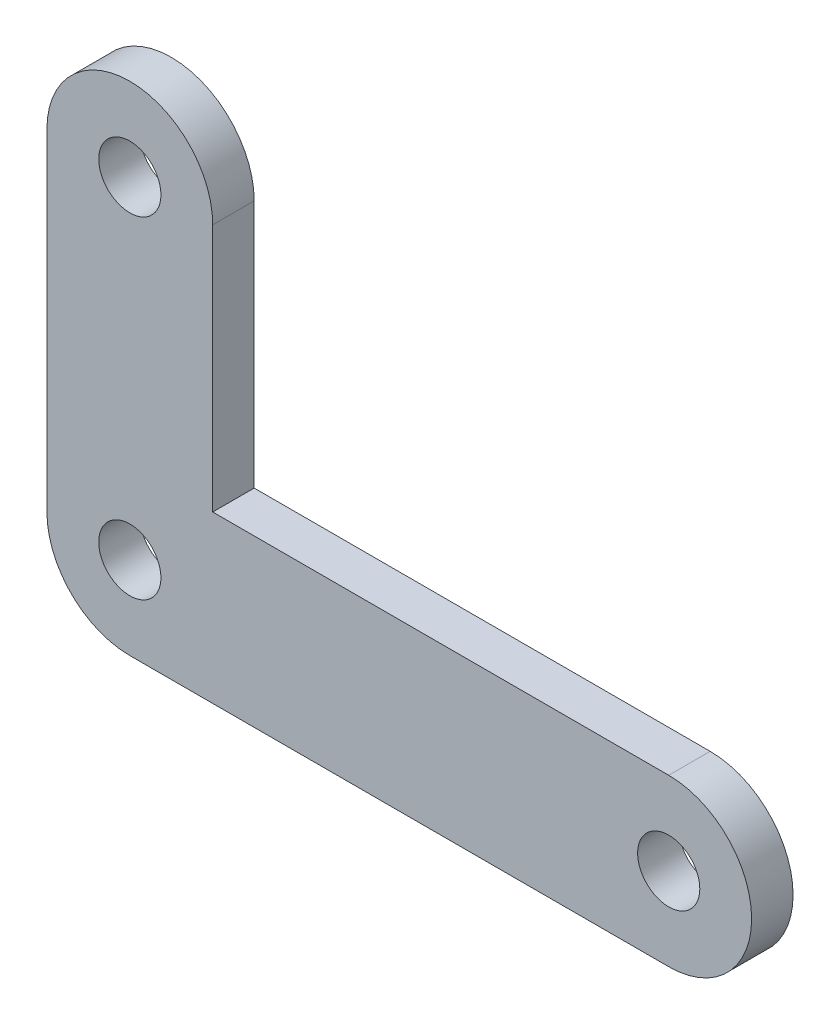
ISO-10303-21;
HEADER;
FILE_DESCRIPTION(('STEP AP214'),'2;1');
FILE_NAME('part.step','',(''),(''),'','','');
FILE_SCHEMA(('AUTOMOTIVE_DESIGN { 1 0 10303 214 1 1 1 1 }'));
ENDSEC;
DATA;
#1=APPLICATION_CONTEXT('core data for automotive mechanical design processes');
#2=APPLICATION_PROTOCOL_DEFINITION('international standard','automotive_design',2000,#1);
#3=PRODUCT_CONTEXT('',#1,'mechanical');
#4=PRODUCT('Part','Part','',(#3));
#5=PRODUCT_RELATED_PRODUCT_CATEGORY('part','',(#4));
#6=PRODUCT_DEFINITION_FORMATION('','',#4);
#7=PRODUCT_DEFINITION_CONTEXT('part definition',#1,'design');
#8=PRODUCT_DEFINITION('design','',#6,#7);
#9=PRODUCT_DEFINITION_SHAPE('','',#8);
#10=(LENGTH_UNIT() NAMED_UNIT(*) SI_UNIT(.MILLI.,.METRE.));
#11=(NAMED_UNIT(*) PLANE_ANGLE_UNIT() SI_UNIT($,.RADIAN.));
#12=(NAMED_UNIT(*) SI_UNIT($,.STERADIAN.) SOLID_ANGLE_UNIT());
#13=UNCERTAINTY_MEASURE_WITH_UNIT(LENGTH_MEASURE(1.E-05),#10,'distance_accuracy_value','');
#14=(GEOMETRIC_REPRESENTATION_CONTEXT(3) GLOBAL_UNCERTAINTY_ASSIGNED_CONTEXT((#13)) GLOBAL_UNIT_ASSIGNED_CONTEXT((#10,
#11,#12)) REPRESENTATION_CONTEXT('',''));
#15=CARTESIAN_POINT('',(0.,0.,0.));
#16=DIRECTION('',(0.,0.,1.));
#17=DIRECTION('',(1.,0.,0.));
#18=AXIS2_PLACEMENT_3D('',#15,#16,#17);
#19=CARTESIAN_POINT('',(-95.2500000000001,0.,6.35));
#20=DIRECTION('',(-1.,0.,0.));
#21=DIRECTION('',(0.,0.,1.));
#22=AXIS2_PLACEMENT_3D('',#19,#20,#21);
#23=PLANE('',#22);
#24=DIRECTION('',(0.,1.,0.));
#25=VECTOR('',#24,1.);
#26=CARTESIAN_POINT('',(-95.2500000000001,0.,0.));
#27=LINE('',#26,#25);
#28=CARTESIAN_POINT('',(-95.25,0.,0.));
#29=VERTEX_POINT('',#28);
#30=CARTESIAN_POINT('',(-95.2500000000001,50.8,0.));
#31=VERTEX_POINT('',#30);
#32=EDGE_CURVE('E133',#29,#31,#27,.T.);
#33=ORIENTED_EDGE('',*,*,#32,.F.);
#34=DIRECTION('',(0.,0.,-1.));
#35=VECTOR('',#34,1.);
#36=CARTESIAN_POINT('',(-95.25,0.,6.35));
#37=LINE('',#36,#35);
#38=CARTESIAN_POINT('',(-95.25,0.,6.35));
#39=VERTEX_POINT('',#38);
#40=EDGE_CURVE('E11',#39,#29,#37,.T.);
#41=ORIENTED_EDGE('',*,*,#40,.F.);
#42=DIRECTION('',(0.,1.,0.));
#43=VECTOR('',#42,1.);
#44=CARTESIAN_POINT('',(-95.2500000000001,0.,6.35));
#45=LINE('',#44,#43);
#46=CARTESIAN_POINT('',(-95.2500000000001,50.8,6.35));
#47=VERTEX_POINT('',#46);
#48=EDGE_CURVE('E157',#39,#47,#45,.T.);
#49=ORIENTED_EDGE('',*,*,#48,.T.);
#50=DIRECTION('',(0.,0.,-1.));
#51=VECTOR('',#50,1.);
#52=CARTESIAN_POINT('',(-95.2500000000001,50.8,6.35));
#53=LINE('',#52,#51);
#54=EDGE_CURVE('E83',#47,#31,#53,.T.);
#55=ORIENTED_EDGE('',*,*,#54,.T.);
#56=EDGE_LOOP('',(#33,#41,#49,#55));
#57=FACE_BOUND('',#56,.T.);
#58=ADVANCED_FACE('F35',(#57),#23,.T.);
#59=CARTESIAN_POINT('',(-82.55,0.,6.35));
#60=DIRECTION('',(0.,0.,-1.));
#61=DIRECTION('',(-1.,0.,0.));
#62=AXIS2_PLACEMENT_3D('',#59,#60,#61);
#63=CYLINDRICAL_SURFACE('',#62,12.7);
#64=CARTESIAN_POINT('',(-82.55,0.,0.));
#65=DIRECTION('',(0.,0.,1.));
#66=DIRECTION('',(1.,0.,0.));
#67=AXIS2_PLACEMENT_3D('',#64,#65,#66);
#68=CIRCLE('',#67,12.7);
#69=CARTESIAN_POINT('',(-82.55,-12.7,0.));
#70=VERTEX_POINT('',#69);
#71=EDGE_CURVE('E136',#29,#70,#68,.T.);
#72=ORIENTED_EDGE('',*,*,#71,.T.);
#73=DIRECTION('',(0.,0.,-1.));
#74=VECTOR('',#73,1.);
#75=CARTESIAN_POINT('',(-82.55,-12.7,6.35));
#76=LINE('',#75,#74);
#77=CARTESIAN_POINT('',(-82.55,-12.7,6.35));
#78=VERTEX_POINT('',#77);
#79=EDGE_CURVE('E43',#78,#70,#76,.T.);
#80=ORIENTED_EDGE('',*,*,#79,.F.);
#81=CARTESIAN_POINT('',(-82.55,0.,6.35));
#82=DIRECTION('',(0.,0.,1.));
#83=DIRECTION('',(1.,0.,0.));
#84=AXIS2_PLACEMENT_3D('',#81,#82,#83);
#85=CIRCLE('',#84,12.7);
#86=EDGE_CURVE('E177',#39,#78,#85,.T.);
#87=ORIENTED_EDGE('',*,*,#86,.F.);
#88=ORIENTED_EDGE('',*,*,#40,.T.);
#89=EDGE_LOOP('',(#72,#80,#87,#88));
#90=FACE_BOUND('',#89,.T.);
#91=ADVANCED_FACE('F170',(#90),#63,.T.);
#92=CARTESIAN_POINT('',(0.,-12.7,6.35));
#93=DIRECTION('',(0.,-1.,0.));
#94=DIRECTION('',(1.,0.,0.));
#95=AXIS2_PLACEMENT_3D('',#92,#93,#94);
#96=PLANE('',#95);
#97=DIRECTION('',(-1.,0.,0.));
#98=VECTOR('',#97,1.);
#99=CARTESIAN_POINT('',(0.,-12.7,0.));
#100=LINE('',#99,#98);
#101=CARTESIAN_POINT('',(0.,-12.7,0.));
#102=VERTEX_POINT('',#101);
#103=EDGE_CURVE('E139',#102,#70,#100,.T.);
#104=ORIENTED_EDGE('',*,*,#103,.F.);
#105=DIRECTION('',(0.,0.,-1.));
#106=VECTOR('',#105,1.);
#107=CARTESIAN_POINT('',(0.,-12.7,6.35));
#108=LINE('',#107,#106);
#109=CARTESIAN_POINT('',(0.,-12.7,6.35));
#110=VERTEX_POINT('',#109);
#111=EDGE_CURVE('E161',#110,#102,#108,.T.);
#112=ORIENTED_EDGE('',*,*,#111,.F.);
#113=DIRECTION('',(-1.,0.,0.));
#114=VECTOR('',#113,1.);
#115=CARTESIAN_POINT('',(0.,-12.7,6.35));
#116=LINE('',#115,#114);
#117=EDGE_CURVE('E167',#110,#78,#116,.T.);
#118=ORIENTED_EDGE('',*,*,#117,.T.);
#119=ORIENTED_EDGE('',*,*,#79,.T.);
#120=EDGE_LOOP('',(#104,#112,#118,#119));
#121=FACE_BOUND('',#120,.T.);
#122=ADVANCED_FACE('F166',(#121),#96,.T.);
#123=CARTESIAN_POINT('',(0.,0.,6.35));
#124=DIRECTION('',(0.,0.,-1.));
#125=DIRECTION('',(-1.,0.,0.));
#126=AXIS2_PLACEMENT_3D('',#123,#124,#125);
#127=CYLINDRICAL_SURFACE('',#126,12.7);
#128=CARTESIAN_POINT('',(0.,0.,0.));
#129=DIRECTION('',(0.,0.,1.));
#130=DIRECTION('',(1.,0.,0.));
#131=AXIS2_PLACEMENT_3D('',#128,#129,#130);
#132=CIRCLE('',#131,12.7);
#133=CARTESIAN_POINT('',(0.,12.7,0.));
#134=VERTEX_POINT('',#133);
#135=EDGE_CURVE('E142',#102,#134,#132,.T.);
#136=ORIENTED_EDGE('',*,*,#135,.T.);
#137=DIRECTION('',(0.,0.,-1.));
#138=VECTOR('',#137,1.);
#139=CARTESIAN_POINT('',(0.,12.7,6.35));
#140=LINE('',#139,#138);
#141=CARTESIAN_POINT('',(0.,12.7,6.35));
#142=VERTEX_POINT('',#141);
#143=EDGE_CURVE('E116',#142,#134,#140,.T.);
#144=ORIENTED_EDGE('',*,*,#143,.F.);
#145=CARTESIAN_POINT('',(0.,0.,6.35));
#146=DIRECTION('',(0.,0.,1.));
#147=DIRECTION('',(1.,0.,0.));
#148=AXIS2_PLACEMENT_3D('',#145,#146,#147);
#149=CIRCLE('',#148,12.7);
#150=EDGE_CURVE('E107',#110,#142,#149,.T.);
#151=ORIENTED_EDGE('',*,*,#150,.F.);
#152=ORIENTED_EDGE('',*,*,#111,.T.);
#153=EDGE_LOOP('',(#136,#144,#151,#152));
#154=FACE_BOUND('',#153,.T.);
#155=ADVANCED_FACE('F176',(#154),#127,.T.);
#156=CARTESIAN_POINT('',(0.,12.7,6.35));
#157=DIRECTION('',(0.,-1.,0.));
#158=DIRECTION('',(1.,0.,0.));
#159=AXIS2_PLACEMENT_3D('',#156,#157,#158);
#160=PLANE('',#159);
#161=DIRECTION('',(-1.,0.,0.));
#162=VECTOR('',#161,1.);
#163=CARTESIAN_POINT('',(0.,12.7,0.));
#164=LINE('',#163,#162);
#165=CARTESIAN_POINT('',(-69.85,12.7,0.));
#166=VERTEX_POINT('',#165);
#167=EDGE_CURVE('E115',#134,#166,#164,.T.);
#168=ORIENTED_EDGE('',*,*,#167,.T.);
#169=DIRECTION('',(0.,0.,-1.));
#170=VECTOR('',#169,1.);
#171=CARTESIAN_POINT('',(-69.85,12.7,6.35));
#172=LINE('',#171,#170);
#173=CARTESIAN_POINT('',(-69.85,12.7,6.35));
#174=VERTEX_POINT('',#173);
#175=EDGE_CURVE('E112',#174,#166,#172,.T.);
#176=ORIENTED_EDGE('',*,*,#175,.F.);
#177=DIRECTION('',(-1.,0.,0.));
#178=VECTOR('',#177,1.);
#179=CARTESIAN_POINT('',(0.,12.7,6.35));
#180=LINE('',#179,#178);
#181=EDGE_CURVE('E99',#142,#174,#180,.T.);
#182=ORIENTED_EDGE('',*,*,#181,.F.);
#183=ORIENTED_EDGE('',*,*,#143,.T.);
#184=EDGE_LOOP('',(#168,#176,#182,#183));
#185=FACE_BOUND('',#184,.T.);
#186=ADVANCED_FACE('F113',(#185),#160,.F.);
#187=CARTESIAN_POINT('',(-69.85,0.,6.35));
#188=DIRECTION('',(-1.,0.,0.));
#189=DIRECTION('',(0.,0.,1.));
#190=AXIS2_PLACEMENT_3D('',#187,#188,#189);
#191=PLANE('',#190);
#192=DIRECTION('',(0.,1.,0.));
#193=VECTOR('',#192,1.);
#194=CARTESIAN_POINT('',(-69.85,0.,0.));
#195=LINE('',#194,#193);
#196=CARTESIAN_POINT('',(-69.85,50.8,0.));
#197=VERTEX_POINT('',#196);
#198=EDGE_CURVE('E76',#166,#197,#195,.T.);
#199=ORIENTED_EDGE('',*,*,#198,.T.);
#200=DIRECTION('',(0.,0.,-1.));
#201=VECTOR('',#200,1.);
#202=CARTESIAN_POINT('',(-69.85,50.8,6.35));
#203=LINE('',#202,#201);
#204=CARTESIAN_POINT('',(-69.85,50.8,6.35));
#205=VERTEX_POINT('',#204);
#206=EDGE_CURVE('E117',#205,#197,#203,.T.);
#207=ORIENTED_EDGE('',*,*,#206,.F.);
#208=DIRECTION('',(0.,1.,0.));
#209=VECTOR('',#208,1.);
#210=CARTESIAN_POINT('',(-69.85,0.,6.35));
#211=LINE('',#210,#209);
#212=EDGE_CURVE('E104',#174,#205,#211,.T.);
#213=ORIENTED_EDGE('',*,*,#212,.F.);
#214=ORIENTED_EDGE('',*,*,#175,.T.);
#215=EDGE_LOOP('',(#199,#207,#213,#214));
#216=FACE_BOUND('',#215,.T.);
#217=ADVANCED_FACE('F119',(#216),#191,.F.);
#218=CARTESIAN_POINT('',(-82.55,0.,6.35));
#219=DIRECTION('',(0.,0.,-1.));
#220=DIRECTION('',(-1.,0.,0.));
#221=AXIS2_PLACEMENT_3D('',#218,#219,#220);
#222=CYLINDRICAL_SURFACE('',#221,4.76250000000001);
#223=CARTESIAN_POINT('',(-82.55,0.,6.35));
#224=DIRECTION('',(0.,0.,1.));
#225=DIRECTION('',(1.,0.,0.));
#226=AXIS2_PLACEMENT_3D('',#223,#224,#225);
#227=CIRCLE('',#226,4.76250000000001);
#228=CARTESIAN_POINT('',(-77.7875,0.,6.35));
#229=VERTEX_POINT('',#228);
#230=EDGE_CURVE('E127',#229,#229,#227,.T.);
#231=ORIENTED_EDGE('',*,*,#230,.T.);
#232=EDGE_LOOP('',(#231));
#233=FACE_BOUND('',#232,.T.);
#234=CARTESIAN_POINT('',(-82.55,0.,0.));
#235=DIRECTION('',(0.,0.,1.));
#236=DIRECTION('',(1.,0.,0.));
#237=AXIS2_PLACEMENT_3D('',#234,#235,#236);
#238=CIRCLE('',#237,4.76250000000001);
#239=CARTESIAN_POINT('',(-77.7875,0.,0.));
#240=VERTEX_POINT('',#239);
#241=EDGE_CURVE('E151',#240,#240,#238,.T.);
#242=ORIENTED_EDGE('',*,*,#241,.F.);
#243=EDGE_LOOP('',(#242));
#244=FACE_BOUND('',#243,.T.);
#245=ADVANCED_FACE('F196',(#233,#244),#222,.F.);
#246=CARTESIAN_POINT('',(-82.55,50.8,6.35));
#247=DIRECTION('',(0.,0.,-1.));
#248=DIRECTION('',(-1.,0.,0.));
#249=AXIS2_PLACEMENT_3D('',#246,#247,#248);
#250=CYLINDRICAL_SURFACE('',#249,4.76250000000001);
#251=CARTESIAN_POINT('',(-82.55,50.8,6.35));
#252=DIRECTION('',(0.,0.,1.));
#253=DIRECTION('',(1.,0.,0.));
#254=AXIS2_PLACEMENT_3D('',#251,#252,#253);
#255=CIRCLE('',#254,4.76250000000001);
#256=CARTESIAN_POINT('',(-77.7875,50.8,6.35));
#257=VERTEX_POINT('',#256);
#258=EDGE_CURVE('E121',#257,#257,#255,.T.);
#259=ORIENTED_EDGE('',*,*,#258,.T.);
#260=EDGE_LOOP('',(#259));
#261=FACE_BOUND('',#260,.T.);
#262=CARTESIAN_POINT('',(-82.55,50.8,0.));
#263=DIRECTION('',(0.,0.,1.));
#264=DIRECTION('',(1.,0.,0.));
#265=AXIS2_PLACEMENT_3D('',#262,#263,#264);
#266=CIRCLE('',#265,4.76250000000001);
#267=CARTESIAN_POINT('',(-77.7875,50.8,0.));
#268=VERTEX_POINT('',#267);
#269=EDGE_CURVE('E148',#268,#268,#266,.T.);
#270=ORIENTED_EDGE('',*,*,#269,.F.);
#271=EDGE_LOOP('',(#270));
#272=FACE_BOUND('',#271,.T.);
#273=ADVANCED_FACE('F201',(#261,#272),#250,.F.);
#274=CARTESIAN_POINT('',(-82.55,50.8,6.35));
#275=DIRECTION('',(0.,0.,-1.));
#276=DIRECTION('',(-1.,0.,0.));
#277=AXIS2_PLACEMENT_3D('',#274,#275,#276);
#278=CYLINDRICAL_SURFACE('',#277,12.7);
#279=CARTESIAN_POINT('',(-82.55,50.8,0.));
#280=DIRECTION('',(0.,0.,1.));
#281=DIRECTION('',(1.,0.,0.));
#282=AXIS2_PLACEMENT_3D('',#279,#280,#281);
#283=CIRCLE('',#282,12.7);
#284=EDGE_CURVE('E146',#197,#31,#283,.T.);
#285=ORIENTED_EDGE('',*,*,#284,.T.);
#286=ORIENTED_EDGE('',*,*,#54,.F.);
#287=CARTESIAN_POINT('',(-82.55,50.8,6.35));
#288=DIRECTION('',(0.,0.,1.));
#289=DIRECTION('',(1.,0.,0.));
#290=AXIS2_PLACEMENT_3D('',#287,#288,#289);
#291=CIRCLE('',#290,12.7);
#292=EDGE_CURVE('E51',#205,#47,#291,.T.);
#293=ORIENTED_EDGE('',*,*,#292,.F.);
#294=ORIENTED_EDGE('',*,*,#206,.T.);
#295=EDGE_LOOP('',(#285,#286,#293,#294));
#296=FACE_BOUND('',#295,.T.);
#297=ADVANCED_FACE('F197',(#296),#278,.T.);
#298=CARTESIAN_POINT('',(0.,0.,6.35));
#299=DIRECTION('',(0.,0.,-1.));
#300=DIRECTION('',(-1.,0.,0.));
#301=AXIS2_PLACEMENT_3D('',#298,#299,#300);
#302=CYLINDRICAL_SURFACE('',#301,4.7625);
#303=CARTESIAN_POINT('',(0.,0.,6.35));
#304=DIRECTION('',(0.,0.,1.));
#305=DIRECTION('',(1.,0.,0.));
#306=AXIS2_PLACEMENT_3D('',#303,#304,#305);
#307=CIRCLE('',#306,4.7625);
#308=CARTESIAN_POINT('',(4.7625,0.,6.35));
#309=VERTEX_POINT('',#308);
#310=EDGE_CURVE('E130',#309,#309,#307,.T.);
#311=ORIENTED_EDGE('',*,*,#310,.T.);
#312=EDGE_LOOP('',(#311));
#313=FACE_BOUND('',#312,.T.);
#314=CARTESIAN_POINT('',(0.,0.,0.));
#315=DIRECTION('',(0.,0.,1.));
#316=DIRECTION('',(1.,0.,0.));
#317=AXIS2_PLACEMENT_3D('',#314,#315,#316);
#318=CIRCLE('',#317,4.7625);
#319=CARTESIAN_POINT('',(4.7625,0.,0.));
#320=VERTEX_POINT('',#319);
#321=EDGE_CURVE('E154',#320,#320,#318,.T.);
#322=ORIENTED_EDGE('',*,*,#321,.F.);
#323=EDGE_LOOP('',(#322));
#324=FACE_BOUND('',#323,.T.);
#325=ADVANCED_FACE('F200',(#313,#324),#302,.F.);
#326=CARTESIAN_POINT('',(0.,0.,6.35));
#327=DIRECTION('',(0.,0.,1.));
#328=DIRECTION('',(1.,0.,0.));
#329=AXIS2_PLACEMENT_3D('',#326,#327,#328);
#330=PLANE('',#329);
#331=ORIENTED_EDGE('',*,*,#48,.F.);
#332=ORIENTED_EDGE('',*,*,#86,.T.);
#333=ORIENTED_EDGE('',*,*,#117,.F.);
#334=ORIENTED_EDGE('',*,*,#150,.T.);
#335=ORIENTED_EDGE('',*,*,#181,.T.);
#336=ORIENTED_EDGE('',*,*,#212,.T.);
#337=ORIENTED_EDGE('',*,*,#292,.T.);
#338=EDGE_LOOP('',(#331,#332,#333,#334,#335,#336,#337));
#339=FACE_BOUND('',#338,.T.);
#340=ORIENTED_EDGE('',*,*,#258,.F.);
#341=EDGE_LOOP('',(#340));
#342=FACE_BOUND('',#341,.T.);
#343=ORIENTED_EDGE('',*,*,#230,.F.);
#344=EDGE_LOOP('',(#343));
#345=FACE_BOUND('',#344,.T.);
#346=ORIENTED_EDGE('',*,*,#310,.F.);
#347=EDGE_LOOP('',(#346));
#348=FACE_BOUND('',#347,.T.);
#349=ADVANCED_FACE('F101',(#339,#342,#345,#348),#330,.T.);
#350=CARTESIAN_POINT('',(0.,0.,0.));
#351=DIRECTION('',(0.,0.,1.));
#352=DIRECTION('',(1.,0.,0.));
#353=AXIS2_PLACEMENT_3D('',#350,#351,#352);
#354=PLANE('',#353);
#355=ORIENTED_EDGE('',*,*,#32,.T.);
#356=ORIENTED_EDGE('',*,*,#284,.F.);
#357=ORIENTED_EDGE('',*,*,#198,.F.);
#358=ORIENTED_EDGE('',*,*,#167,.F.);
#359=ORIENTED_EDGE('',*,*,#135,.F.);
#360=ORIENTED_EDGE('',*,*,#103,.T.);
#361=ORIENTED_EDGE('',*,*,#71,.F.);
#362=EDGE_LOOP('',(#355,#356,#357,#358,#359,#360,#361));
#363=FACE_BOUND('',#362,.T.);
#364=ORIENTED_EDGE('',*,*,#269,.T.);
#365=EDGE_LOOP('',(#364));
#366=FACE_BOUND('',#365,.T.);
#367=ORIENTED_EDGE('',*,*,#241,.T.);
#368=EDGE_LOOP('',(#367));
#369=FACE_BOUND('',#368,.T.);
#370=ORIENTED_EDGE('',*,*,#321,.T.);
#371=EDGE_LOOP('',(#370));
#372=FACE_BOUND('',#371,.T.);
#373=ADVANCED_FACE('F173',(#363,#366,#369,#372),#354,.F.);
#374=CLOSED_SHELL('',(#58,#91,#122,#155,#186,#217,#245,#273,#297,#325,#349,#373));
#375=MANIFOLD_SOLID_BREP('B2',#374);
#376=ADVANCED_BREP_SHAPE_REPRESENTATION('',(#18,#375),#14);
#377=SHAPE_DEFINITION_REPRESENTATION(#9,#376);
ENDSEC;
END-ISO-10303-21;
